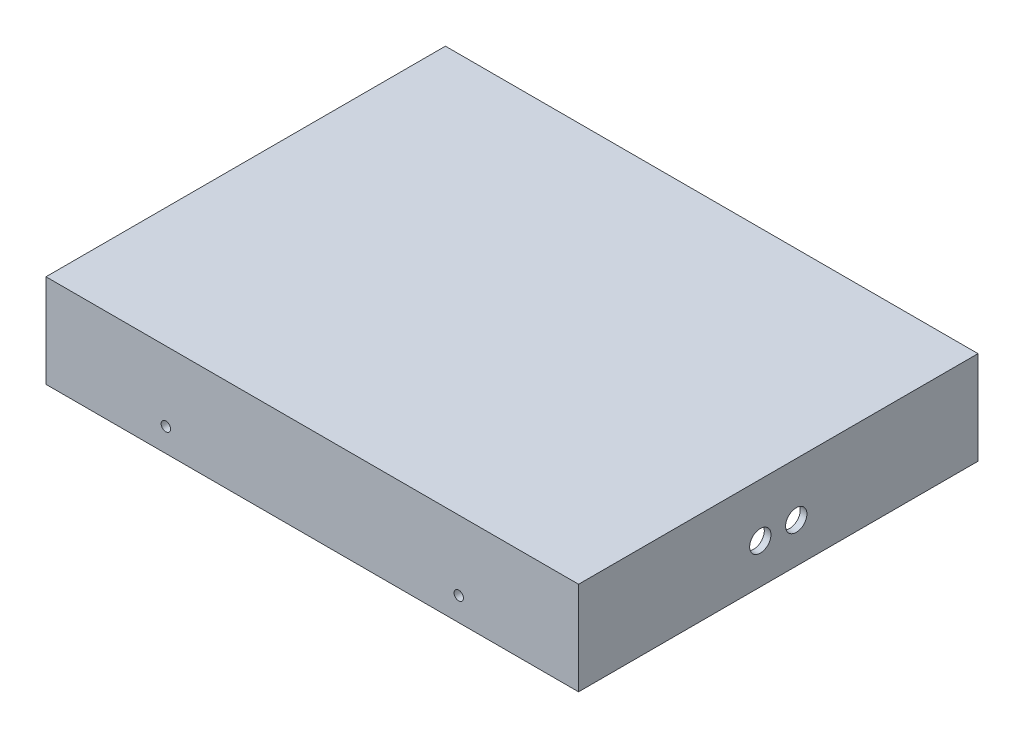
ISO-10303-21;
HEADER;
FILE_DESCRIPTION(('STEP AP214'),'2;1');
FILE_NAME('part.step','',(''),(''),'','','');
FILE_SCHEMA(('AUTOMOTIVE_DESIGN { 1 0 10303 214 1 1 1 1 }'));
ENDSEC;
DATA;
#1=APPLICATION_CONTEXT('core data for automotive mechanical design processes');
#2=APPLICATION_PROTOCOL_DEFINITION('international standard','automotive_design',2000,#1);
#3=PRODUCT_CONTEXT('',#1,'mechanical');
#4=PRODUCT('Part','Part','',(#3));
#5=PRODUCT_RELATED_PRODUCT_CATEGORY('part','',(#4));
#6=PRODUCT_DEFINITION_FORMATION('','',#4);
#7=PRODUCT_DEFINITION_CONTEXT('part definition',#1,'design');
#8=PRODUCT_DEFINITION('design','',#6,#7);
#9=PRODUCT_DEFINITION_SHAPE('','',#8);
#10=(LENGTH_UNIT() NAMED_UNIT(*) SI_UNIT(.MILLI.,.METRE.));
#11=(NAMED_UNIT(*) PLANE_ANGLE_UNIT() SI_UNIT($,.RADIAN.));
#12=(NAMED_UNIT(*) SI_UNIT($,.STERADIAN.) SOLID_ANGLE_UNIT());
#13=UNCERTAINTY_MEASURE_WITH_UNIT(LENGTH_MEASURE(1.E-05),#10,'distance_accuracy_value','');
#14=(GEOMETRIC_REPRESENTATION_CONTEXT(3) GLOBAL_UNCERTAINTY_ASSIGNED_CONTEXT((#13)) GLOBAL_UNIT_ASSIGNED_CONTEXT((#10,
#11,#12)) REPRESENTATION_CONTEXT('',''));
#15=CARTESIAN_POINT('',(0.,0.,0.));
#16=DIRECTION('',(0.,0.,1.));
#17=DIRECTION('',(1.,0.,0.));
#18=AXIS2_PLACEMENT_3D('',#15,#16,#17);
#19=CARTESIAN_POINT('',(200.,70.,-150.));
#20=DIRECTION('',(-1.,0.,0.));
#21=DIRECTION('',(0.,0.,1.));
#22=AXIS2_PLACEMENT_3D('',#19,#20,#21);
#23=PLANE('',#22);
#24=CARTESIAN_POINT('',(200.,30.,13.5));
#25=DIRECTION('',(1.,0.,0.));
#26=DIRECTION('',(0.,0.,-1.));
#27=AXIS2_PLACEMENT_3D('',#24,#25,#26);
#28=CIRCLE('',#27,8.00000000000041);
#29=CARTESIAN_POINT('',(200.,30.,5.49999999999959));
#30=VERTEX_POINT('',#29);
#31=EDGE_CURVE('E225',#30,#30,#28,.T.);
#32=ORIENTED_EDGE('',*,*,#31,.F.);
#33=EDGE_LOOP('',(#32));
#34=FACE_BOUND('',#33,.T.);
#35=CARTESIAN_POINT('',(200.,30.,-13.5));
#36=DIRECTION('',(1.,0.,0.));
#37=DIRECTION('',(0.,0.,1.));
#38=AXIS2_PLACEMENT_3D('',#35,#36,#37);
#39=CIRCLE('',#38,8.00000000000041);
#40=CARTESIAN_POINT('',(200.,30.,-5.49999999999959));
#41=VERTEX_POINT('',#40);
#42=EDGE_CURVE('E265',#41,#41,#39,.T.);
#43=ORIENTED_EDGE('',*,*,#42,.F.);
#44=EDGE_LOOP('',(#43));
#45=FACE_BOUND('',#44,.T.);
#46=DIRECTION('',(0.,0.,-1.));
#47=VECTOR('',#46,1.);
#48=CARTESIAN_POINT('',(200.,0.,-150.));
#49=LINE('',#48,#47);
#50=CARTESIAN_POINT('',(200.,0.,150.));
#51=VERTEX_POINT('',#50);
#52=CARTESIAN_POINT('',(200.,0.,-150.));
#53=VERTEX_POINT('',#52);
#54=EDGE_CURVE('E163',#51,#53,#49,.T.);
#55=ORIENTED_EDGE('',*,*,#54,.T.);
#56=DIRECTION('',(0.,-1.,0.));
#57=VECTOR('',#56,1.);
#58=CARTESIAN_POINT('',(200.,70.,-150.));
#59=LINE('',#58,#57);
#60=CARTESIAN_POINT('',(200.,70.,-150.));
#61=VERTEX_POINT('',#60);
#62=EDGE_CURVE('E142',#61,#53,#59,.T.);
#63=ORIENTED_EDGE('',*,*,#62,.F.);
#64=DIRECTION('',(0.,0.,-1.));
#65=VECTOR('',#64,1.);
#66=CARTESIAN_POINT('',(200.,70.,-150.));
#67=LINE('',#66,#65);
#68=CARTESIAN_POINT('',(200.,70.,150.));
#69=VERTEX_POINT('',#68);
#70=EDGE_CURVE('E150',#69,#61,#67,.T.);
#71=ORIENTED_EDGE('',*,*,#70,.F.);
#72=DIRECTION('',(0.,-1.,0.));
#73=VECTOR('',#72,1.);
#74=CARTESIAN_POINT('',(200.,70.,150.));
#75=LINE('',#74,#73);
#76=EDGE_CURVE('E306',#69,#51,#75,.T.);
#77=ORIENTED_EDGE('',*,*,#76,.T.);
#78=EDGE_LOOP('',(#55,#63,#71,#77));
#79=FACE_BOUND('',#78,.T.);
#80=ADVANCED_FACE('F47',(#34,#45,#79),#23,.F.);
#81=CARTESIAN_POINT('',(-200.,70.,-150.));
#82=DIRECTION('',(0.,0.,1.));
#83=DIRECTION('',(1.,0.,0.));
#84=AXIS2_PLACEMENT_3D('',#81,#82,#83);
#85=PLANE('',#84);
#86=CARTESIAN_POINT('',(-110.,17.6700881522899,-150.));
#87=DIRECTION('',(0.,0.,1.));
#88=DIRECTION('',(1.,0.,0.));
#89=AXIS2_PLACEMENT_3D('',#86,#87,#88);
#90=CIRCLE('',#89,3.535);
#91=CARTESIAN_POINT('',(-106.465,17.6700881522899,-150.));
#92=VERTEX_POINT('',#91);
#93=EDGE_CURVE('E261',#92,#92,#90,.T.);
#94=ORIENTED_EDGE('',*,*,#93,.T.);
#95=EDGE_LOOP('',(#94));
#96=FACE_BOUND('',#95,.T.);
#97=CARTESIAN_POINT('',(110.,17.6700881522899,-150.));
#98=DIRECTION('',(0.,0.,1.));
#99=DIRECTION('',(1.,0.,0.));
#100=AXIS2_PLACEMENT_3D('',#97,#98,#99);
#101=CIRCLE('',#100,3.535);
#102=CARTESIAN_POINT('',(113.535,17.6700881522899,-150.));
#103=VERTEX_POINT('',#102);
#104=EDGE_CURVE('E241',#103,#103,#101,.T.);
#105=ORIENTED_EDGE('',*,*,#104,.T.);
#106=EDGE_LOOP('',(#105));
#107=FACE_BOUND('',#106,.T.);
#108=DIRECTION('',(-1.,0.,0.));
#109=VECTOR('',#108,1.);
#110=CARTESIAN_POINT('',(-200.,0.,-150.));
#111=LINE('',#110,#109);
#112=CARTESIAN_POINT('',(-200.,0.,-150.));
#113=VERTEX_POINT('',#112);
#114=EDGE_CURVE('E309',#53,#113,#111,.T.);
#115=ORIENTED_EDGE('',*,*,#114,.T.);
#116=DIRECTION('',(0.,-1.,0.));
#117=VECTOR('',#116,1.);
#118=CARTESIAN_POINT('',(-200.,70.,-150.));
#119=LINE('',#118,#117);
#120=CARTESIAN_POINT('',(-200.,70.,-150.));
#121=VERTEX_POINT('',#120);
#122=EDGE_CURVE('E145',#121,#113,#119,.T.);
#123=ORIENTED_EDGE('',*,*,#122,.F.);
#124=DIRECTION('',(-1.,0.,0.));
#125=VECTOR('',#124,1.);
#126=CARTESIAN_POINT('',(-200.,70.,-150.));
#127=LINE('',#126,#125);
#128=EDGE_CURVE('E138',#61,#121,#127,.T.);
#129=ORIENTED_EDGE('',*,*,#128,.F.);
#130=ORIENTED_EDGE('',*,*,#62,.T.);
#131=EDGE_LOOP('',(#115,#123,#129,#130));
#132=FACE_BOUND('',#131,.T.);
#133=ADVANCED_FACE('F140',(#96,#107,#132),#85,.F.);
#134=CARTESIAN_POINT('',(-200.,70.,-150.));
#135=DIRECTION('',(1.,0.,0.));
#136=DIRECTION('',(0.,0.,-1.));
#137=AXIS2_PLACEMENT_3D('',#134,#135,#136);
#138=PLANE('',#137);
#139=DIRECTION('',(0.,0.,1.));
#140=VECTOR('',#139,1.);
#141=CARTESIAN_POINT('',(-200.,0.,-150.));
#142=LINE('',#141,#140);
#143=CARTESIAN_POINT('',(-200.,0.,150.));
#144=VERTEX_POINT('',#143);
#145=EDGE_CURVE('E312',#113,#144,#142,.T.);
#146=ORIENTED_EDGE('',*,*,#145,.T.);
#147=DIRECTION('',(0.,-1.,0.));
#148=VECTOR('',#147,1.);
#149=CARTESIAN_POINT('',(-200.,70.,150.));
#150=LINE('',#149,#148);
#151=CARTESIAN_POINT('',(-200.,70.,150.));
#152=VERTEX_POINT('',#151);
#153=EDGE_CURVE('E173',#152,#144,#150,.T.);
#154=ORIENTED_EDGE('',*,*,#153,.F.);
#155=DIRECTION('',(0.,0.,1.));
#156=VECTOR('',#155,1.);
#157=CARTESIAN_POINT('',(-200.,70.,-150.));
#158=LINE('',#157,#156);
#159=EDGE_CURVE('E149',#121,#152,#158,.T.);
#160=ORIENTED_EDGE('',*,*,#159,.F.);
#161=ORIENTED_EDGE('',*,*,#122,.T.);
#162=EDGE_LOOP('',(#146,#154,#160,#161));
#163=FACE_BOUND('',#162,.T.);
#164=ADVANCED_FACE('F330',(#163),#138,.F.);
#165=CARTESIAN_POINT('',(-200.,70.,150.));
#166=DIRECTION('',(0.,0.,-1.));
#167=DIRECTION('',(-1.,0.,0.));
#168=AXIS2_PLACEMENT_3D('',#165,#166,#167);
#169=PLANE('',#168);
#170=CARTESIAN_POINT('',(-110.,17.6700881522899,150.));
#171=DIRECTION('',(0.,0.,1.));
#172=DIRECTION('',(1.,0.,0.));
#173=AXIS2_PLACEMENT_3D('',#170,#171,#172);
#174=CIRCLE('',#173,3.535);
#175=CARTESIAN_POINT('',(-106.465,17.6700881522899,150.));
#176=VERTEX_POINT('',#175);
#177=EDGE_CURVE('E233',#176,#176,#174,.T.);
#178=ORIENTED_EDGE('',*,*,#177,.F.);
#179=EDGE_LOOP('',(#178));
#180=FACE_BOUND('',#179,.T.);
#181=CARTESIAN_POINT('',(110.,17.6700881522899,150.));
#182=DIRECTION('',(0.,0.,1.));
#183=DIRECTION('',(-1.,0.,0.));
#184=AXIS2_PLACEMENT_3D('',#181,#182,#183);
#185=CIRCLE('',#184,3.535);
#186=CARTESIAN_POINT('',(106.465,17.6700881522899,150.));
#187=VERTEX_POINT('',#186);
#188=EDGE_CURVE('E244',#187,#187,#185,.T.);
#189=ORIENTED_EDGE('',*,*,#188,.F.);
#190=EDGE_LOOP('',(#189));
#191=FACE_BOUND('',#190,.T.);
#192=DIRECTION('',(1.,0.,0.));
#193=VECTOR('',#192,1.);
#194=CARTESIAN_POINT('',(-200.,0.,150.));
#195=LINE('',#194,#193);
#196=EDGE_CURVE('E160',#144,#51,#195,.T.);
#197=ORIENTED_EDGE('',*,*,#196,.T.);
#198=ORIENTED_EDGE('',*,*,#76,.F.);
#199=DIRECTION('',(1.,0.,0.));
#200=VECTOR('',#199,1.);
#201=CARTESIAN_POINT('',(-200.,70.,150.));
#202=LINE('',#201,#200);
#203=EDGE_CURVE('E155',#152,#69,#202,.T.);
#204=ORIENTED_EDGE('',*,*,#203,.F.);
#205=ORIENTED_EDGE('',*,*,#153,.T.);
#206=EDGE_LOOP('',(#197,#198,#204,#205));
#207=FACE_BOUND('',#206,.T.);
#208=ADVANCED_FACE('F325',(#180,#191,#207),#169,.F.);
#209=CARTESIAN_POINT('',(0.,70.,0.));
#210=DIRECTION('',(0.,1.,0.));
#211=DIRECTION('',(0.,0.,1.));
#212=AXIS2_PLACEMENT_3D('',#209,#210,#211);
#213=PLANE('',#212);
#214=ORIENTED_EDGE('',*,*,#70,.T.);
#215=ORIENTED_EDGE('',*,*,#128,.T.);
#216=ORIENTED_EDGE('',*,*,#159,.T.);
#217=ORIENTED_EDGE('',*,*,#203,.T.);
#218=EDGE_LOOP('',(#214,#215,#216,#217));
#219=FACE_BOUND('',#218,.T.);
#220=ADVANCED_FACE('F153',(#219),#213,.T.);
#221=CARTESIAN_POINT('',(0.,0.,0.));
#222=DIRECTION('',(0.,1.,0.));
#223=DIRECTION('',(0.,0.,1.));
#224=AXIS2_PLACEMENT_3D('',#221,#222,#223);
#225=PLANE('',#224);
#226=DIRECTION('',(-1.,0.,0.));
#227=VECTOR('',#226,1.);
#228=CARTESIAN_POINT('',(-195.,0.,145.));
#229=LINE('',#228,#227);
#230=CARTESIAN_POINT('',(185.,0.,145.));
#231=VERTEX_POINT('',#230);
#232=CARTESIAN_POINT('',(-185.,0.,145.));
#233=VERTEX_POINT('',#232);
#234=EDGE_CURVE('E292',#231,#233,#229,.T.);
#235=ORIENTED_EDGE('',*,*,#234,.F.);
#236=CARTESIAN_POINT('',(185.,0.,135.));
#237=DIRECTION('',(0.,1.,0.));
#238=DIRECTION('',(0.,0.,1.));
#239=AXIS2_PLACEMENT_3D('',#236,#237,#238);
#240=CIRCLE('',#239,10.);
#241=CARTESIAN_POINT('',(195.,0.,135.));
#242=VERTEX_POINT('',#241);
#243=EDGE_CURVE('E212',#231,#242,#240,.T.);
#244=ORIENTED_EDGE('',*,*,#243,.T.);
#245=DIRECTION('',(0.,0.,1.));
#246=VECTOR('',#245,1.);
#247=CARTESIAN_POINT('',(195.,0.,145.));
#248=LINE('',#247,#246);
#249=CARTESIAN_POINT('',(195.,0.,-135.));
#250=VERTEX_POINT('',#249);
#251=EDGE_CURVE('E228',#250,#242,#248,.T.);
#252=ORIENTED_EDGE('',*,*,#251,.F.);
#253=CARTESIAN_POINT('',(185.,0.,-135.));
#254=DIRECTION('',(0.,1.,0.));
#255=DIRECTION('',(0.,0.,1.));
#256=AXIS2_PLACEMENT_3D('',#253,#254,#255);
#257=CIRCLE('',#256,10.);
#258=CARTESIAN_POINT('',(185.,0.,-145.));
#259=VERTEX_POINT('',#258);
#260=EDGE_CURVE('E215',#250,#259,#257,.T.);
#261=ORIENTED_EDGE('',*,*,#260,.T.);
#262=DIRECTION('',(1.,0.,0.));
#263=VECTOR('',#262,1.);
#264=CARTESIAN_POINT('',(-195.,0.,-145.));
#265=LINE('',#264,#263);
#266=CARTESIAN_POINT('',(-185.,0.,-145.));
#267=VERTEX_POINT('',#266);
#268=EDGE_CURVE('E277',#267,#259,#265,.T.);
#269=ORIENTED_EDGE('',*,*,#268,.F.);
#270=CARTESIAN_POINT('',(-185.,0.,-135.));
#271=DIRECTION('',(0.,1.,0.));
#272=DIRECTION('',(0.,0.,1.));
#273=AXIS2_PLACEMENT_3D('',#270,#271,#272);
#274=CIRCLE('',#273,10.);
#275=CARTESIAN_POINT('',(-195.,0.,-135.));
#276=VERTEX_POINT('',#275);
#277=EDGE_CURVE('E57',#267,#276,#274,.T.);
#278=ORIENTED_EDGE('',*,*,#277,.T.);
#279=DIRECTION('',(0.,0.,-1.));
#280=VECTOR('',#279,1.);
#281=CARTESIAN_POINT('',(-195.,0.,145.));
#282=LINE('',#281,#280);
#283=CARTESIAN_POINT('',(-195.,0.,135.));
#284=VERTEX_POINT('',#283);
#285=EDGE_CURVE('E296',#284,#276,#282,.T.);
#286=ORIENTED_EDGE('',*,*,#285,.F.);
#287=CARTESIAN_POINT('',(-185.,0.,135.));
#288=DIRECTION('',(0.,1.,0.));
#289=DIRECTION('',(0.,0.,1.));
#290=AXIS2_PLACEMENT_3D('',#287,#288,#289);
#291=CIRCLE('',#290,10.);
#292=EDGE_CURVE('E11',#284,#233,#291,.T.);
#293=ORIENTED_EDGE('',*,*,#292,.T.);
#294=EDGE_LOOP('',(#235,#244,#252,#261,#269,#278,#286,#293));
#295=FACE_BOUND('',#294,.T.);
#296=ORIENTED_EDGE('',*,*,#54,.F.);
#297=ORIENTED_EDGE('',*,*,#196,.F.);
#298=ORIENTED_EDGE('',*,*,#145,.F.);
#299=ORIENTED_EDGE('',*,*,#114,.F.);
#300=EDGE_LOOP('',(#296,#297,#298,#299));
#301=FACE_BOUND('',#300,.T.);
#302=ADVANCED_FACE('F329',(#295,#301),#225,.F.);
#303=CARTESIAN_POINT('',(195.,60.,145.));
#304=DIRECTION('',(1.,0.,0.));
#305=DIRECTION('',(0.,0.,-1.));
#306=AXIS2_PLACEMENT_3D('',#303,#304,#305);
#307=PLANE('',#306);
#308=CARTESIAN_POINT('',(195.,30.,13.5));
#309=DIRECTION('',(1.,0.,0.));
#310=DIRECTION('',(0.,0.,-1.));
#311=AXIS2_PLACEMENT_3D('',#308,#309,#310);
#312=CIRCLE('',#311,8.00000000000041);
#313=CARTESIAN_POINT('',(195.,30.,5.49999999999959));
#314=VERTEX_POINT('',#313);
#315=EDGE_CURVE('E224',#314,#314,#312,.T.);
#316=ORIENTED_EDGE('',*,*,#315,.T.);
#317=EDGE_LOOP('',(#316));
#318=FACE_BOUND('',#317,.T.);
#319=CARTESIAN_POINT('',(195.,30.,-13.5));
#320=DIRECTION('',(1.,0.,0.));
#321=DIRECTION('',(0.,0.,-1.));
#322=AXIS2_PLACEMENT_3D('',#319,#320,#321);
#323=CIRCLE('',#322,8.00000000000041);
#324=CARTESIAN_POINT('',(195.,30.,-21.5000000000004));
#325=VERTEX_POINT('',#324);
#326=EDGE_CURVE('E220',#325,#325,#323,.T.);
#327=ORIENTED_EDGE('',*,*,#326,.T.);
#328=EDGE_LOOP('',(#327));
#329=FACE_BOUND('',#328,.T.);
#330=ORIENTED_EDGE('',*,*,#251,.T.);
#331=DIRECTION('',(0.,-1.,0.));
#332=VECTOR('',#331,1.);
#333=CARTESIAN_POINT('',(195.,60.,135.));
#334=LINE('',#333,#332);
#335=CARTESIAN_POINT('',(195.,60.,135.));
#336=VERTEX_POINT('',#335);
#337=EDGE_CURVE('E184',#242,#336,#334,.F.);
#338=ORIENTED_EDGE('',*,*,#337,.T.);
#339=DIRECTION('',(0.,0.,1.));
#340=VECTOR('',#339,1.);
#341=CARTESIAN_POINT('',(195.,60.,145.));
#342=LINE('',#341,#340);
#343=CARTESIAN_POINT('',(195.,60.,-135.));
#344=VERTEX_POINT('',#343);
#345=EDGE_CURVE('E272',#344,#336,#342,.T.);
#346=ORIENTED_EDGE('',*,*,#345,.F.);
#347=DIRECTION('',(0.,-1.,0.));
#348=VECTOR('',#347,1.);
#349=CARTESIAN_POINT('',(195.,0.,-135.));
#350=LINE('',#349,#348);
#351=EDGE_CURVE('E180',#344,#250,#350,.T.);
#352=ORIENTED_EDGE('',*,*,#351,.T.);
#353=EDGE_LOOP('',(#330,#338,#346,#352));
#354=FACE_BOUND('',#353,.T.);
#355=ADVANCED_FACE('F378',(#318,#329,#354),#307,.F.);
#356=CARTESIAN_POINT('',(-195.,60.,-145.));
#357=DIRECTION('',(0.,0.,-1.));
#358=DIRECTION('',(-1.,0.,0.));
#359=AXIS2_PLACEMENT_3D('',#356,#357,#358);
#360=PLANE('',#359);
#361=CARTESIAN_POINT('',(-110.,17.6700881522899,-145.));
#362=DIRECTION('',(0.,0.,-1.));
#363=DIRECTION('',(-1.,0.,0.));
#364=AXIS2_PLACEMENT_3D('',#361,#362,#363);
#365=CIRCLE('',#364,3.535);
#366=CARTESIAN_POINT('',(-113.535,17.6700881522899,-145.));
#367=VERTEX_POINT('',#366);
#368=EDGE_CURVE('E257',#367,#367,#365,.T.);
#369=ORIENTED_EDGE('',*,*,#368,.T.);
#370=EDGE_LOOP('',(#369));
#371=FACE_BOUND('',#370,.T.);
#372=CARTESIAN_POINT('',(110.,17.6700881522899,-145.));
#373=DIRECTION('',(0.,0.,-1.));
#374=DIRECTION('',(-1.,0.,0.));
#375=AXIS2_PLACEMENT_3D('',#372,#373,#374);
#376=CIRCLE('',#375,3.535);
#377=CARTESIAN_POINT('',(106.465,17.6700881522899,-145.));
#378=VERTEX_POINT('',#377);
#379=EDGE_CURVE('E232',#378,#378,#376,.T.);
#380=ORIENTED_EDGE('',*,*,#379,.T.);
#381=EDGE_LOOP('',(#380));
#382=FACE_BOUND('',#381,.T.);
#383=ORIENTED_EDGE('',*,*,#268,.T.);
#384=DIRECTION('',(0.,-1.,0.));
#385=VECTOR('',#384,1.);
#386=CARTESIAN_POINT('',(185.,60.,-145.));
#387=LINE('',#386,#385);
#388=CARTESIAN_POINT('',(185.,60.,-145.));
#389=VERTEX_POINT('',#388);
#390=EDGE_CURVE('E203',#259,#389,#387,.F.);
#391=ORIENTED_EDGE('',*,*,#390,.T.);
#392=DIRECTION('',(1.,0.,0.));
#393=VECTOR('',#392,1.);
#394=CARTESIAN_POINT('',(-195.,60.,-145.));
#395=LINE('',#394,#393);
#396=CARTESIAN_POINT('',(-185.,60.,-145.));
#397=VERTEX_POINT('',#396);
#398=EDGE_CURVE('E285',#397,#389,#395,.T.);
#399=ORIENTED_EDGE('',*,*,#398,.F.);
#400=DIRECTION('',(0.,-1.,0.));
#401=VECTOR('',#400,1.);
#402=CARTESIAN_POINT('',(-185.,0.,-145.));
#403=LINE('',#402,#401);
#404=EDGE_CURVE('E199',#397,#267,#403,.T.);
#405=ORIENTED_EDGE('',*,*,#404,.T.);
#406=EDGE_LOOP('',(#383,#391,#399,#405));
#407=FACE_BOUND('',#406,.T.);
#408=ADVANCED_FACE('F372',(#371,#382,#407),#360,.F.);
#409=CARTESIAN_POINT('',(-195.,60.,145.));
#410=DIRECTION('',(-1.,0.,0.));
#411=DIRECTION('',(0.,0.,1.));
#412=AXIS2_PLACEMENT_3D('',#409,#410,#411);
#413=PLANE('',#412);
#414=ORIENTED_EDGE('',*,*,#285,.T.);
#415=DIRECTION('',(0.,-1.,0.));
#416=VECTOR('',#415,1.);
#417=CARTESIAN_POINT('',(-195.,60.,-135.));
#418=LINE('',#417,#416);
#419=CARTESIAN_POINT('',(-195.,60.,-135.));
#420=VERTEX_POINT('',#419);
#421=EDGE_CURVE('E209',#276,#420,#418,.F.);
#422=ORIENTED_EDGE('',*,*,#421,.T.);
#423=DIRECTION('',(0.,0.,-1.));
#424=VECTOR('',#423,1.);
#425=CARTESIAN_POINT('',(-195.,60.,145.));
#426=LINE('',#425,#424);
#427=CARTESIAN_POINT('',(-195.,60.,135.));
#428=VERTEX_POINT('',#427);
#429=EDGE_CURVE('E281',#428,#420,#426,.T.);
#430=ORIENTED_EDGE('',*,*,#429,.F.);
#431=DIRECTION('',(0.,-1.,0.));
#432=VECTOR('',#431,1.);
#433=CARTESIAN_POINT('',(-195.,0.,135.));
#434=LINE('',#433,#432);
#435=EDGE_CURVE('E206',#428,#284,#434,.T.);
#436=ORIENTED_EDGE('',*,*,#435,.T.);
#437=EDGE_LOOP('',(#414,#422,#430,#436));
#438=FACE_BOUND('',#437,.T.);
#439=ADVANCED_FACE('F388',(#438),#413,.F.);
#440=CARTESIAN_POINT('',(-195.,60.,145.));
#441=DIRECTION('',(0.,0.,1.));
#442=DIRECTION('',(1.,0.,0.));
#443=AXIS2_PLACEMENT_3D('',#440,#441,#442);
#444=PLANE('',#443);
#445=CARTESIAN_POINT('',(-110.,17.6700881522899,145.));
#446=DIRECTION('',(0.,0.,1.));
#447=DIRECTION('',(1.,0.,0.));
#448=AXIS2_PLACEMENT_3D('',#445,#446,#447);
#449=CIRCLE('',#448,3.535);
#450=CARTESIAN_POINT('',(-106.465,17.6700881522899,145.));
#451=VERTEX_POINT('',#450);
#452=EDGE_CURVE('E51',#451,#451,#449,.T.);
#453=ORIENTED_EDGE('',*,*,#452,.T.);
#454=EDGE_LOOP('',(#453));
#455=FACE_BOUND('',#454,.T.);
#456=CARTESIAN_POINT('',(110.,17.6700881522899,145.));
#457=DIRECTION('',(0.,0.,1.));
#458=DIRECTION('',(1.,0.,0.));
#459=AXIS2_PLACEMENT_3D('',#456,#457,#458);
#460=CIRCLE('',#459,3.535);
#461=CARTESIAN_POINT('',(113.535,17.6700881522899,145.));
#462=VERTEX_POINT('',#461);
#463=EDGE_CURVE('E229',#462,#462,#460,.T.);
#464=ORIENTED_EDGE('',*,*,#463,.T.);
#465=EDGE_LOOP('',(#464));
#466=FACE_BOUND('',#465,.T.);
#467=DIRECTION('',(-1.,0.,0.));
#468=VECTOR('',#467,1.);
#469=CARTESIAN_POINT('',(-195.,60.,145.));
#470=LINE('',#469,#468);
#471=CARTESIAN_POINT('',(185.,60.,145.));
#472=VERTEX_POINT('',#471);
#473=CARTESIAN_POINT('',(-185.,60.,145.));
#474=VERTEX_POINT('',#473);
#475=EDGE_CURVE('E276',#472,#474,#470,.T.);
#476=ORIENTED_EDGE('',*,*,#475,.F.);
#477=DIRECTION('',(0.,-1.,0.));
#478=VECTOR('',#477,1.);
#479=CARTESIAN_POINT('',(185.,0.,145.));
#480=LINE('',#479,#478);
#481=EDGE_CURVE('E171',#472,#231,#480,.T.);
#482=ORIENTED_EDGE('',*,*,#481,.T.);
#483=ORIENTED_EDGE('',*,*,#234,.T.);
#484=DIRECTION('',(0.,-1.,0.));
#485=VECTOR('',#484,1.);
#486=CARTESIAN_POINT('',(-185.,60.,145.));
#487=LINE('',#486,#485);
#488=EDGE_CURVE('E165',#233,#474,#487,.F.);
#489=ORIENTED_EDGE('',*,*,#488,.T.);
#490=EDGE_LOOP('',(#476,#482,#483,#489));
#491=FACE_BOUND('',#490,.T.);
#492=ADVANCED_FACE('F385',(#455,#466,#491),#444,.F.);
#493=CARTESIAN_POINT('',(0.,60.,0.));
#494=DIRECTION('',(0.,-1.,0.));
#495=DIRECTION('',(0.,0.,-1.));
#496=AXIS2_PLACEMENT_3D('',#493,#494,#495);
#497=PLANE('',#496);
#498=ORIENTED_EDGE('',*,*,#345,.T.);
#499=CARTESIAN_POINT('',(185.,60.,135.));
#500=DIRECTION('',(0.,-1.,0.));
#501=DIRECTION('',(0.,0.,-1.));
#502=AXIS2_PLACEMENT_3D('',#499,#500,#501);
#503=CIRCLE('',#502,10.);
#504=EDGE_CURVE('E196',#336,#472,#503,.T.);
#505=ORIENTED_EDGE('',*,*,#504,.T.);
#506=ORIENTED_EDGE('',*,*,#475,.T.);
#507=CARTESIAN_POINT('',(-185.,60.,135.));
#508=DIRECTION('',(0.,-1.,0.));
#509=DIRECTION('',(0.,0.,-1.));
#510=AXIS2_PLACEMENT_3D('',#507,#508,#509);
#511=CIRCLE('',#510,10.);
#512=EDGE_CURVE('E187',#474,#428,#511,.T.);
#513=ORIENTED_EDGE('',*,*,#512,.T.);
#514=ORIENTED_EDGE('',*,*,#429,.T.);
#515=CARTESIAN_POINT('',(-185.,60.,-135.));
#516=DIRECTION('',(0.,-1.,0.));
#517=DIRECTION('',(0.,0.,-1.));
#518=AXIS2_PLACEMENT_3D('',#515,#516,#517);
#519=CIRCLE('',#518,10.);
#520=EDGE_CURVE('E190',#420,#397,#519,.T.);
#521=ORIENTED_EDGE('',*,*,#520,.T.);
#522=ORIENTED_EDGE('',*,*,#398,.T.);
#523=CARTESIAN_POINT('',(185.,60.,-135.));
#524=DIRECTION('',(0.,-1.,0.));
#525=DIRECTION('',(0.,0.,-1.));
#526=AXIS2_PLACEMENT_3D('',#523,#524,#525);
#527=CIRCLE('',#526,10.);
#528=EDGE_CURVE('E193',#389,#344,#527,.T.);
#529=ORIENTED_EDGE('',*,*,#528,.T.);
#530=EDGE_LOOP('',(#498,#505,#506,#513,#514,#521,#522,#529));
#531=FACE_BOUND('',#530,.T.);
#532=ADVANCED_FACE('F353',(#531),#497,.T.);
#533=CARTESIAN_POINT('',(185.,60.,135.));
#534=DIRECTION('',(0.,1.,0.));
#535=DIRECTION('',(0.,0.,1.));
#536=AXIS2_PLACEMENT_3D('',#533,#534,#535);
#537=CYLINDRICAL_SURFACE('',#536,10.);
#538=ORIENTED_EDGE('',*,*,#504,.F.);
#539=ORIENTED_EDGE('',*,*,#337,.F.);
#540=ORIENTED_EDGE('',*,*,#243,.F.);
#541=ORIENTED_EDGE('',*,*,#481,.F.);
#542=EDGE_LOOP('',(#538,#539,#540,#541));
#543=FACE_BOUND('',#542,.T.);
#544=ADVANCED_FACE('F349',(#543),#537,.F.);
#545=CARTESIAN_POINT('',(185.,60.,-135.));
#546=DIRECTION('',(0.,1.,0.));
#547=DIRECTION('',(0.,0.,1.));
#548=AXIS2_PLACEMENT_3D('',#545,#546,#547);
#549=CYLINDRICAL_SURFACE('',#548,10.);
#550=ORIENTED_EDGE('',*,*,#528,.F.);
#551=ORIENTED_EDGE('',*,*,#390,.F.);
#552=ORIENTED_EDGE('',*,*,#260,.F.);
#553=ORIENTED_EDGE('',*,*,#351,.F.);
#554=EDGE_LOOP('',(#550,#551,#552,#553));
#555=FACE_BOUND('',#554,.T.);
#556=ADVANCED_FACE('F352',(#555),#549,.F.);
#557=CARTESIAN_POINT('',(-185.,60.,-135.));
#558=DIRECTION('',(0.,1.,0.));
#559=DIRECTION('',(0.,0.,1.));
#560=AXIS2_PLACEMENT_3D('',#557,#558,#559);
#561=CYLINDRICAL_SURFACE('',#560,10.);
#562=ORIENTED_EDGE('',*,*,#520,.F.);
#563=ORIENTED_EDGE('',*,*,#421,.F.);
#564=ORIENTED_EDGE('',*,*,#277,.F.);
#565=ORIENTED_EDGE('',*,*,#404,.F.);
#566=EDGE_LOOP('',(#562,#563,#564,#565));
#567=FACE_BOUND('',#566,.T.);
#568=ADVANCED_FACE('F356',(#567),#561,.F.);
#569=CARTESIAN_POINT('',(-185.,60.,135.));
#570=DIRECTION('',(0.,1.,0.));
#571=DIRECTION('',(0.,0.,1.));
#572=AXIS2_PLACEMENT_3D('',#569,#570,#571);
#573=CYLINDRICAL_SURFACE('',#572,10.);
#574=ORIENTED_EDGE('',*,*,#512,.F.);
#575=ORIENTED_EDGE('',*,*,#488,.F.);
#576=ORIENTED_EDGE('',*,*,#292,.F.);
#577=ORIENTED_EDGE('',*,*,#435,.F.);
#578=EDGE_LOOP('',(#574,#575,#576,#577));
#579=FACE_BOUND('',#578,.T.);
#580=ADVANCED_FACE('F49',(#579),#573,.F.);
#581=CARTESIAN_POINT('',(190.,30.,-13.5));
#582=DIRECTION('',(1.,0.,0.));
#583=DIRECTION('',(0.,0.,-1.));
#584=AXIS2_PLACEMENT_3D('',#581,#582,#583);
#585=CYLINDRICAL_SURFACE('',#584,8.00000000000041);
#586=ORIENTED_EDGE('',*,*,#42,.T.);
#587=EDGE_LOOP('',(#586));
#588=FACE_BOUND('',#587,.T.);
#589=ORIENTED_EDGE('',*,*,#326,.F.);
#590=EDGE_LOOP('',(#589));
#591=FACE_BOUND('',#590,.T.);
#592=ADVANCED_FACE('F363',(#588,#591),#585,.F.);
#593=CARTESIAN_POINT('',(190.,30.,13.5));
#594=DIRECTION('',(1.,0.,0.));
#595=DIRECTION('',(0.,0.,-1.));
#596=AXIS2_PLACEMENT_3D('',#593,#594,#595);
#597=CYLINDRICAL_SURFACE('',#596,8.00000000000041);
#598=ORIENTED_EDGE('',*,*,#31,.T.);
#599=EDGE_LOOP('',(#598));
#600=FACE_BOUND('',#599,.T.);
#601=ORIENTED_EDGE('',*,*,#315,.F.);
#602=EDGE_LOOP('',(#601));
#603=FACE_BOUND('',#602,.T.);
#604=ADVANCED_FACE('F411',(#600,#603),#597,.F.);
#605=CARTESIAN_POINT('',(110.,17.6700881522899,-309.));
#606=DIRECTION('',(0.,0.,1.));
#607=DIRECTION('',(1.,0.,0.));
#608=AXIS2_PLACEMENT_3D('',#605,#606,#607);
#609=CYLINDRICAL_SURFACE('',#608,3.535);
#610=ORIENTED_EDGE('',*,*,#188,.T.);
#611=EDGE_LOOP('',(#610));
#612=FACE_BOUND('',#611,.T.);
#613=ORIENTED_EDGE('',*,*,#463,.F.);
#614=EDGE_LOOP('',(#613));
#615=FACE_BOUND('',#614,.T.);
#616=ADVANCED_FACE('F415',(#612,#615),#609,.F.);
#617=CARTESIAN_POINT('',(-110.,17.6700881522899,-309.));
#618=DIRECTION('',(0.,0.,1.));
#619=DIRECTION('',(1.,0.,0.));
#620=AXIS2_PLACEMENT_3D('',#617,#618,#619);
#621=CYLINDRICAL_SURFACE('',#620,3.535);
#622=ORIENTED_EDGE('',*,*,#177,.T.);
#623=EDGE_LOOP('',(#622));
#624=FACE_BOUND('',#623,.T.);
#625=ORIENTED_EDGE('',*,*,#452,.F.);
#626=EDGE_LOOP('',(#625));
#627=FACE_BOUND('',#626,.T.);
#628=ADVANCED_FACE('F421',(#624,#627),#621,.F.);
#629=ORIENTED_EDGE('',*,*,#379,.F.);
#630=EDGE_LOOP('',(#629));
#631=FACE_BOUND('',#630,.T.);
#632=ORIENTED_EDGE('',*,*,#104,.F.);
#633=EDGE_LOOP('',(#632));
#634=FACE_BOUND('',#633,.T.);
#635=ADVANCED_FACE('F417',(#631,#634),#609,.F.);
#636=ORIENTED_EDGE('',*,*,#368,.F.);
#637=EDGE_LOOP('',(#636));
#638=FACE_BOUND('',#637,.T.);
#639=ORIENTED_EDGE('',*,*,#93,.F.);
#640=EDGE_LOOP('',(#639));
#641=FACE_BOUND('',#640,.T.);
#642=ADVANCED_FACE('F420',(#638,#641),#621,.F.);
#643=CLOSED_SHELL('',(#80,#133,#164,#208,#220,#302,#355,#408,#439,#492,#532,#544,#556,#568,#580,
#592,#604,#616,#628,#635,#642));
#644=MANIFOLD_SOLID_BREP('B2',#643);
#645=ADVANCED_BREP_SHAPE_REPRESENTATION('',(#18,#644),#14);
#646=SHAPE_DEFINITION_REPRESENTATION(#9,#645);
ENDSEC;
END-ISO-10303-21;
